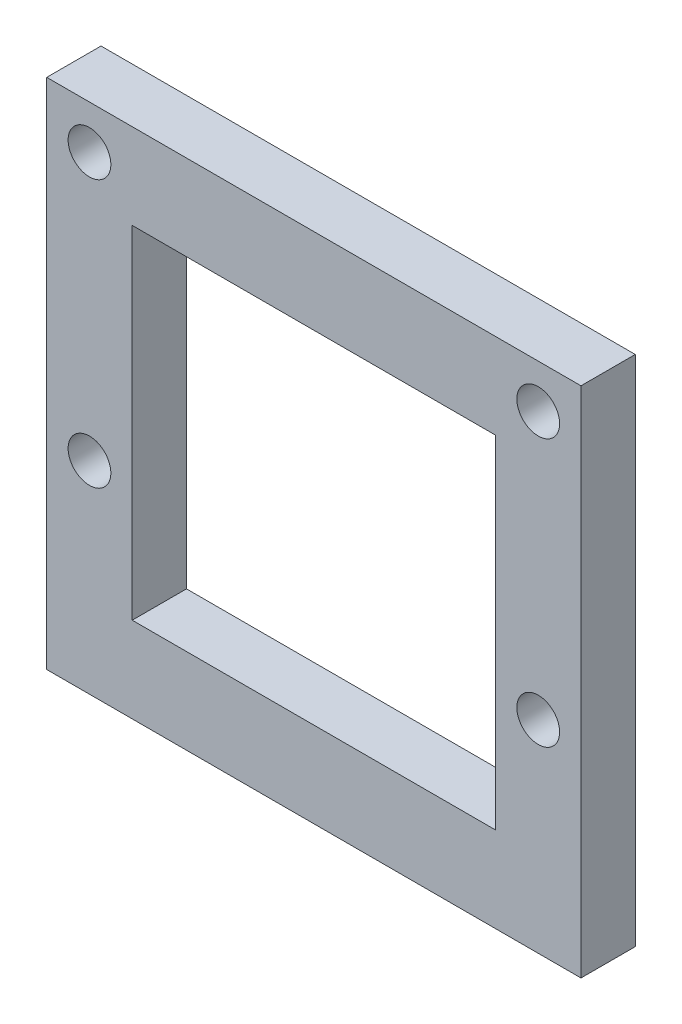
ISO-10303-21;
HEADER;
FILE_DESCRIPTION(('STEP AP214'),'2;1');
FILE_NAME('part.step','',(''),(''),'','','');
FILE_SCHEMA(('AUTOMOTIVE_DESIGN { 1 0 10303 214 1 1 1 1 }'));
ENDSEC;
DATA;
#1=APPLICATION_CONTEXT('core data for automotive mechanical design processes');
#2=APPLICATION_PROTOCOL_DEFINITION('international standard','automotive_design',2000,#1);
#3=PRODUCT_CONTEXT('',#1,'mechanical');
#4=PRODUCT('Part','Part','',(#3));
#5=PRODUCT_RELATED_PRODUCT_CATEGORY('part','',(#4));
#6=PRODUCT_DEFINITION_FORMATION('','',#4);
#7=PRODUCT_DEFINITION_CONTEXT('part definition',#1,'design');
#8=PRODUCT_DEFINITION('design','',#6,#7);
#9=PRODUCT_DEFINITION_SHAPE('','',#8);
#10=(LENGTH_UNIT() NAMED_UNIT(*) SI_UNIT(.MILLI.,.METRE.));
#11=(NAMED_UNIT(*) PLANE_ANGLE_UNIT() SI_UNIT($,.RADIAN.));
#12=(NAMED_UNIT(*) SI_UNIT($,.STERADIAN.) SOLID_ANGLE_UNIT());
#13=UNCERTAINTY_MEASURE_WITH_UNIT(LENGTH_MEASURE(1.E-05),#10,'distance_accuracy_value','');
#14=(GEOMETRIC_REPRESENTATION_CONTEXT(3) GLOBAL_UNCERTAINTY_ASSIGNED_CONTEXT((#13)) GLOBAL_UNIT_ASSIGNED_CONTEXT((#10,
#11,#12)) REPRESENTATION_CONTEXT('',''));
#15=CARTESIAN_POINT('',(0.,0.,0.));
#16=DIRECTION('',(0.,0.,1.));
#17=DIRECTION('',(1.,0.,0.));
#18=AXIS2_PLACEMENT_3D('',#15,#16,#17);
#19=CARTESIAN_POINT('',(0.,0.,2.54));
#20=DIRECTION('',(0.,0.,1.));
#21=DIRECTION('',(1.,0.,0.));
#22=AXIS2_PLACEMENT_3D('',#19,#20,#21);
#23=PLANE('',#22);
#24=CARTESIAN_POINT('',(-10.500000336,-2.53656255804224,2.54));
#25=DIRECTION('',(0.,0.,1.));
#26=DIRECTION('',(1.,0.,0.));
#27=AXIS2_PLACEMENT_3D('',#24,#25,#26);
#28=CIRCLE('',#27,1.000000032);
#29=CARTESIAN_POINT('',(-9.500000304,-2.53656255804224,2.54));
#30=VERTEX_POINT('',#29);
#31=EDGE_CURVE('E46',#30,#30,#28,.F.);
#32=ORIENTED_EDGE('',*,*,#31,.T.);
#33=EDGE_LOOP('',(#32));
#34=FACE_BOUND('',#33,.T.);
#35=CARTESIAN_POINT('',(10.500000336,9.96343784195776,2.54));
#36=DIRECTION('',(0.,0.,1.));
#37=DIRECTION('',(1.,0.,0.));
#38=AXIS2_PLACEMENT_3D('',#35,#36,#37);
#39=CIRCLE('',#38,1.000000032);
#40=CARTESIAN_POINT('',(11.500000368,9.96343784195776,2.54));
#41=VERTEX_POINT('',#40);
#42=EDGE_CURVE('E203',#41,#41,#39,.F.);
#43=ORIENTED_EDGE('',*,*,#42,.T.);
#44=EDGE_LOOP('',(#43));
#45=FACE_BOUND('',#44,.T.);
#46=CARTESIAN_POINT('',(10.500000336,-2.53656255804224,2.54));
#47=DIRECTION('',(0.,0.,1.));
#48=DIRECTION('',(1.,0.,0.));
#49=AXIS2_PLACEMENT_3D('',#46,#47,#48);
#50=CIRCLE('',#49,1.000000032);
#51=CARTESIAN_POINT('',(11.500000368,-2.53656255804224,2.54));
#52=VERTEX_POINT('',#51);
#53=EDGE_CURVE('E199',#52,#52,#50,.F.);
#54=ORIENTED_EDGE('',*,*,#53,.T.);
#55=EDGE_LOOP('',(#54));
#56=FACE_BOUND('',#55,.T.);
#57=CARTESIAN_POINT('',(-10.500000336,9.96343784195776,2.54));
#58=DIRECTION('',(0.,0.,1.));
#59=DIRECTION('',(1.,0.,0.));
#60=AXIS2_PLACEMENT_3D('',#57,#58,#59);
#61=CIRCLE('',#60,1.000000032);
#62=CARTESIAN_POINT('',(-9.500000304,9.96343784195776,2.54));
#63=VERTEX_POINT('',#62);
#64=EDGE_CURVE('E195',#63,#63,#61,.F.);
#65=ORIENTED_EDGE('',*,*,#64,.T.);
#66=EDGE_LOOP('',(#65));
#67=FACE_BOUND('',#66,.T.);
#68=DIRECTION('',(0.,1.,0.));
#69=VECTOR('',#68,1.);
#70=CARTESIAN_POINT('',(12.5000004,12.00000013,2.54));
#71=LINE('',#70,#69);
#72=CARTESIAN_POINT('',(12.5000004,-12.00000013,2.54));
#73=VERTEX_POINT('',#72);
#74=CARTESIAN_POINT('',(12.5000004,12.00000013,2.54));
#75=VERTEX_POINT('',#74);
#76=EDGE_CURVE('E159',#73,#75,#71,.T.);
#77=ORIENTED_EDGE('',*,*,#76,.T.);
#78=DIRECTION('',(-1.,0.,0.));
#79=VECTOR('',#78,1.);
#80=CARTESIAN_POINT('',(-12.5000004,12.00000013,2.54));
#81=LINE('',#80,#79);
#82=CARTESIAN_POINT('',(-12.5000004,12.00000013,2.54));
#83=VERTEX_POINT('',#82);
#84=EDGE_CURVE('E163',#75,#83,#81,.T.);
#85=ORIENTED_EDGE('',*,*,#84,.T.);
#86=DIRECTION('',(0.,-1.,0.));
#87=VECTOR('',#86,1.);
#88=CARTESIAN_POINT('',(-12.5000004,12.00000013,2.54));
#89=LINE('',#88,#87);
#90=CARTESIAN_POINT('',(-12.5000004,-12.00000013,2.54));
#91=VERTEX_POINT('',#90);
#92=EDGE_CURVE('E167',#83,#91,#89,.T.);
#93=ORIENTED_EDGE('',*,*,#92,.T.);
#94=DIRECTION('',(1.,0.,0.));
#95=VECTOR('',#94,1.);
#96=CARTESIAN_POINT('',(-12.5000004,-12.00000013,2.54));
#97=LINE('',#96,#95);
#98=EDGE_CURVE('E170',#91,#73,#97,.T.);
#99=ORIENTED_EDGE('',*,*,#98,.T.);
#100=EDGE_LOOP('',(#77,#85,#93,#99));
#101=FACE_BOUND('',#100,.T.);
#102=DIRECTION('',(-1.,0.,0.));
#103=VECTOR('',#102,1.);
#104=CARTESIAN_POINT('',(-8.500000272,8.000000002,2.54));
#105=LINE('',#104,#103);
#106=CARTESIAN_POINT('',(8.50000027199999,8.000000002,2.54));
#107=VERTEX_POINT('',#106);
#108=CARTESIAN_POINT('',(-8.500000272,8.000000002,2.54));
#109=VERTEX_POINT('',#108);
#110=EDGE_CURVE('E119',#107,#109,#105,.T.);
#111=ORIENTED_EDGE('',*,*,#110,.F.);
#112=DIRECTION('',(0.,1.,0.));
#113=VECTOR('',#112,1.);
#114=CARTESIAN_POINT('',(8.50000027199999,-8.000000002,2.54));
#115=LINE('',#114,#113);
#116=CARTESIAN_POINT('',(8.50000027199999,-8.000000002,2.54));
#117=VERTEX_POINT('',#116);
#118=EDGE_CURVE('E110',#117,#107,#115,.T.);
#119=ORIENTED_EDGE('',*,*,#118,.F.);
#120=DIRECTION('',(1.,0.,0.));
#121=VECTOR('',#120,1.);
#122=CARTESIAN_POINT('',(-8.500000272,-8.000000002,2.54));
#123=LINE('',#122,#121);
#124=CARTESIAN_POINT('',(-8.500000272,-8.000000002,2.54));
#125=VERTEX_POINT('',#124);
#126=EDGE_CURVE('E136',#125,#117,#123,.T.);
#127=ORIENTED_EDGE('',*,*,#126,.F.);
#128=DIRECTION('',(0.,-1.,0.));
#129=VECTOR('',#128,1.);
#130=CARTESIAN_POINT('',(-8.500000272,-8.000000002,2.54));
#131=LINE('',#130,#129);
#132=EDGE_CURVE('E132',#109,#125,#131,.T.);
#133=ORIENTED_EDGE('',*,*,#132,.F.);
#134=EDGE_LOOP('',(#111,#119,#127,#133));
#135=FACE_BOUND('',#134,.T.);
#136=ADVANCED_FACE('F42',(#34,#45,#56,#67,#101,#135),#23,.T.);
#137=CARTESIAN_POINT('',(0.,0.,0.));
#138=DIRECTION('',(0.,0.,1.));
#139=DIRECTION('',(1.,0.,0.));
#140=AXIS2_PLACEMENT_3D('',#137,#138,#139);
#141=PLANE('',#140);
#142=DIRECTION('',(0.,1.,0.));
#143=VECTOR('',#142,1.);
#144=CARTESIAN_POINT('',(12.5000004,12.00000013,0.));
#145=LINE('',#144,#143);
#146=CARTESIAN_POINT('',(12.5000004,-12.00000013,0.));
#147=VERTEX_POINT('',#146);
#148=CARTESIAN_POINT('',(12.5000004,12.00000013,0.));
#149=VERTEX_POINT('',#148);
#150=EDGE_CURVE('E128',#147,#149,#145,.T.);
#151=ORIENTED_EDGE('',*,*,#150,.F.);
#152=DIRECTION('',(1.,0.,0.));
#153=VECTOR('',#152,1.);
#154=CARTESIAN_POINT('',(-12.5000004,-12.00000013,0.));
#155=LINE('',#154,#153);
#156=CARTESIAN_POINT('',(-12.5000004,-12.00000013,0.));
#157=VERTEX_POINT('',#156);
#158=EDGE_CURVE('E164',#157,#147,#155,.T.);
#159=ORIENTED_EDGE('',*,*,#158,.F.);
#160=DIRECTION('',(0.,-1.,0.));
#161=VECTOR('',#160,1.);
#162=CARTESIAN_POINT('',(-12.5000004,12.00000013,0.));
#163=LINE('',#162,#161);
#164=CARTESIAN_POINT('',(-12.5000004,12.00000013,0.));
#165=VERTEX_POINT('',#164);
#166=EDGE_CURVE('E180',#165,#157,#163,.T.);
#167=ORIENTED_EDGE('',*,*,#166,.F.);
#168=DIRECTION('',(-1.,0.,0.));
#169=VECTOR('',#168,1.);
#170=CARTESIAN_POINT('',(-12.5000004,12.00000013,0.));
#171=LINE('',#170,#169);
#172=EDGE_CURVE('E177',#149,#165,#171,.T.);
#173=ORIENTED_EDGE('',*,*,#172,.F.);
#174=EDGE_LOOP('',(#151,#159,#167,#173));
#175=FACE_BOUND('',#174,.T.);
#176=DIRECTION('',(0.,1.,0.));
#177=VECTOR('',#176,1.);
#178=CARTESIAN_POINT('',(8.50000027199999,-8.000000002,0.));
#179=LINE('',#178,#177);
#180=CARTESIAN_POINT('',(8.50000027199999,-8.000000002,0.));
#181=VERTEX_POINT('',#180);
#182=CARTESIAN_POINT('',(8.50000027199999,8.000000002,0.));
#183=VERTEX_POINT('',#182);
#184=EDGE_CURVE('E68',#181,#183,#179,.T.);
#185=ORIENTED_EDGE('',*,*,#184,.T.);
#186=DIRECTION('',(-1.,0.,0.));
#187=VECTOR('',#186,1.);
#188=CARTESIAN_POINT('',(-8.500000272,8.000000002,0.));
#189=LINE('',#188,#187);
#190=CARTESIAN_POINT('',(-8.500000272,8.000000002,0.));
#191=VERTEX_POINT('',#190);
#192=EDGE_CURVE('E126',#183,#191,#189,.T.);
#193=ORIENTED_EDGE('',*,*,#192,.T.);
#194=DIRECTION('',(0.,-1.,0.));
#195=VECTOR('',#194,1.);
#196=CARTESIAN_POINT('',(-8.500000272,-8.000000002,0.));
#197=LINE('',#196,#195);
#198=CARTESIAN_POINT('',(-8.500000272,-8.000000002,0.));
#199=VERTEX_POINT('',#198);
#200=EDGE_CURVE('E146',#191,#199,#197,.T.);
#201=ORIENTED_EDGE('',*,*,#200,.T.);
#202=DIRECTION('',(1.,0.,0.));
#203=VECTOR('',#202,1.);
#204=CARTESIAN_POINT('',(-8.500000272,-8.000000002,0.));
#205=LINE('',#204,#203);
#206=EDGE_CURVE('E120',#199,#181,#205,.T.);
#207=ORIENTED_EDGE('',*,*,#206,.T.);
#208=EDGE_LOOP('',(#185,#193,#201,#207));
#209=FACE_BOUND('',#208,.T.);
#210=ADVANCED_FACE('F255',(#175,#209),#141,.F.);
#211=CARTESIAN_POINT('',(12.5000004,12.00000013,2.54));
#212=DIRECTION('',(-1.,0.,0.));
#213=DIRECTION('',(0.,-1.,0.));
#214=AXIS2_PLACEMENT_3D('',#211,#212,#213);
#215=PLANE('',#214);
#216=ORIENTED_EDGE('',*,*,#150,.T.);
#217=DIRECTION('',(0.,0.,-1.));
#218=VECTOR('',#217,1.);
#219=CARTESIAN_POINT('',(12.5000004,12.00000013,2.54));
#220=LINE('',#219,#218);
#221=EDGE_CURVE('E11',#75,#149,#220,.T.);
#222=ORIENTED_EDGE('',*,*,#221,.F.);
#223=ORIENTED_EDGE('',*,*,#76,.F.);
#224=DIRECTION('',(0.,0.,-1.));
#225=VECTOR('',#224,1.);
#226=CARTESIAN_POINT('',(12.5000004,-12.00000013,2.54));
#227=LINE('',#226,#225);
#228=EDGE_CURVE('E173',#73,#147,#227,.T.);
#229=ORIENTED_EDGE('',*,*,#228,.T.);
#230=EDGE_LOOP('',(#216,#222,#223,#229));
#231=FACE_BOUND('',#230,.T.);
#232=ADVANCED_FACE('F44',(#231),#215,.F.);
#233=CARTESIAN_POINT('',(-12.5000004,12.00000013,2.54));
#234=DIRECTION('',(0.,-1.,0.));
#235=DIRECTION('',(0.,0.,-1.));
#236=AXIS2_PLACEMENT_3D('',#233,#234,#235);
#237=PLANE('',#236);
#238=ORIENTED_EDGE('',*,*,#172,.T.);
#239=DIRECTION('',(0.,0.,-1.));
#240=VECTOR('',#239,1.);
#241=CARTESIAN_POINT('',(-12.5000004,12.00000013,2.54));
#242=LINE('',#241,#240);
#243=EDGE_CURVE('E52',#83,#165,#242,.T.);
#244=ORIENTED_EDGE('',*,*,#243,.F.);
#245=ORIENTED_EDGE('',*,*,#84,.F.);
#246=ORIENTED_EDGE('',*,*,#221,.T.);
#247=EDGE_LOOP('',(#238,#244,#245,#246));
#248=FACE_BOUND('',#247,.T.);
#249=ADVANCED_FACE('F271',(#248),#237,.F.);
#250=CARTESIAN_POINT('',(-12.5000004,12.00000013,2.54));
#251=DIRECTION('',(1.,0.,0.));
#252=DIRECTION('',(0.,1.,0.));
#253=AXIS2_PLACEMENT_3D('',#250,#251,#252);
#254=PLANE('',#253);
#255=ORIENTED_EDGE('',*,*,#166,.T.);
#256=DIRECTION('',(0.,0.,-1.));
#257=VECTOR('',#256,1.);
#258=CARTESIAN_POINT('',(-12.5000004,-12.00000013,2.54));
#259=LINE('',#258,#257);
#260=EDGE_CURVE('E188',#91,#157,#259,.T.);
#261=ORIENTED_EDGE('',*,*,#260,.F.);
#262=ORIENTED_EDGE('',*,*,#92,.F.);
#263=ORIENTED_EDGE('',*,*,#243,.T.);
#264=EDGE_LOOP('',(#255,#261,#262,#263));
#265=FACE_BOUND('',#264,.T.);
#266=ADVANCED_FACE('F268',(#265),#254,.F.);
#267=CARTESIAN_POINT('',(-12.5000004,-12.00000013,2.54));
#268=DIRECTION('',(0.,1.,0.));
#269=DIRECTION('',(0.,0.,1.));
#270=AXIS2_PLACEMENT_3D('',#267,#268,#269);
#271=PLANE('',#270);
#272=ORIENTED_EDGE('',*,*,#158,.T.);
#273=ORIENTED_EDGE('',*,*,#228,.F.);
#274=ORIENTED_EDGE('',*,*,#98,.F.);
#275=ORIENTED_EDGE('',*,*,#260,.T.);
#276=EDGE_LOOP('',(#272,#273,#274,#275));
#277=FACE_BOUND('',#276,.T.);
#278=ADVANCED_FACE('F265',(#277),#271,.F.);
#279=CARTESIAN_POINT('',(8.50000027199999,-8.000000002,2.54));
#280=DIRECTION('',(-1.,0.,0.));
#281=DIRECTION('',(0.,0.,1.));
#282=AXIS2_PLACEMENT_3D('',#279,#280,#281);
#283=PLANE('',#282);
#284=ORIENTED_EDGE('',*,*,#184,.F.);
#285=DIRECTION('',(0.,0.,-1.));
#286=VECTOR('',#285,1.);
#287=CARTESIAN_POINT('',(8.50000027199999,-8.000000002,2.54));
#288=LINE('',#287,#286);
#289=EDGE_CURVE('E114',#117,#181,#288,.T.);
#290=ORIENTED_EDGE('',*,*,#289,.F.);
#291=ORIENTED_EDGE('',*,*,#118,.T.);
#292=DIRECTION('',(0.,0.,-1.));
#293=VECTOR('',#292,1.);
#294=CARTESIAN_POINT('',(8.50000027199999,8.000000002,2.54));
#295=LINE('',#294,#293);
#296=EDGE_CURVE('E113',#107,#183,#295,.T.);
#297=ORIENTED_EDGE('',*,*,#296,.T.);
#298=EDGE_LOOP('',(#284,#290,#291,#297));
#299=FACE_BOUND('',#298,.T.);
#300=ADVANCED_FACE('F112',(#299),#283,.T.);
#301=CARTESIAN_POINT('',(-8.500000272,8.000000002,2.54));
#302=DIRECTION('',(0.,-1.,0.));
#303=DIRECTION('',(0.,0.,-1.));
#304=AXIS2_PLACEMENT_3D('',#301,#302,#303);
#305=PLANE('',#304);
#306=ORIENTED_EDGE('',*,*,#192,.F.);
#307=ORIENTED_EDGE('',*,*,#296,.F.);
#308=ORIENTED_EDGE('',*,*,#110,.T.);
#309=DIRECTION('',(0.,0.,-1.));
#310=VECTOR('',#309,1.);
#311=CARTESIAN_POINT('',(-8.500000272,8.000000002,2.54));
#312=LINE('',#311,#310);
#313=EDGE_CURVE('E129',#109,#191,#312,.T.);
#314=ORIENTED_EDGE('',*,*,#313,.T.);
#315=EDGE_LOOP('',(#306,#307,#308,#314));
#316=FACE_BOUND('',#315,.T.);
#317=ADVANCED_FACE('F123',(#316),#305,.T.);
#318=CARTESIAN_POINT('',(-8.500000272,-8.000000002,2.54));
#319=DIRECTION('',(1.,0.,0.));
#320=DIRECTION('',(0.,0.,-1.));
#321=AXIS2_PLACEMENT_3D('',#318,#319,#320);
#322=PLANE('',#321);
#323=ORIENTED_EDGE('',*,*,#200,.F.);
#324=ORIENTED_EDGE('',*,*,#313,.F.);
#325=ORIENTED_EDGE('',*,*,#132,.T.);
#326=DIRECTION('',(0.,0.,-1.));
#327=VECTOR('',#326,1.);
#328=CARTESIAN_POINT('',(-8.500000272,-8.000000002,2.54));
#329=LINE('',#328,#327);
#330=EDGE_CURVE('E60',#125,#199,#329,.T.);
#331=ORIENTED_EDGE('',*,*,#330,.T.);
#332=EDGE_LOOP('',(#323,#324,#325,#331));
#333=FACE_BOUND('',#332,.T.);
#334=ADVANCED_FACE('F294',(#333),#322,.T.);
#335=CARTESIAN_POINT('',(-8.500000272,-8.000000002,2.54));
#336=DIRECTION('',(0.,1.,0.));
#337=DIRECTION('',(0.,0.,1.));
#338=AXIS2_PLACEMENT_3D('',#335,#336,#337);
#339=PLANE('',#338);
#340=ORIENTED_EDGE('',*,*,#206,.F.);
#341=ORIENTED_EDGE('',*,*,#330,.F.);
#342=ORIENTED_EDGE('',*,*,#126,.T.);
#343=ORIENTED_EDGE('',*,*,#289,.T.);
#344=EDGE_LOOP('',(#340,#341,#342,#343));
#345=FACE_BOUND('',#344,.T.);
#346=ADVANCED_FACE('F292',(#345),#339,.T.);
#347=CARTESIAN_POINT('',(-10.500000336,9.96343784195776,3.175));
#348=DIRECTION('',(0.,0.,-1.));
#349=DIRECTION('',(-1.,0.,0.));
#350=AXIS2_PLACEMENT_3D('',#347,#348,#349);
#351=CYLINDRICAL_SURFACE('',#350,1.000000032);
#352=ORIENTED_EDGE('',*,*,#64,.F.);
#353=EDGE_LOOP('',(#352));
#354=FACE_BOUND('',#353,.T.);
#355=CARTESIAN_POINT('',(-10.500000336,9.96343784195776,0.635));
#356=DIRECTION('',(0.,0.,1.));
#357=DIRECTION('',(1.,0.,0.));
#358=AXIS2_PLACEMENT_3D('',#355,#356,#357);
#359=CIRCLE('',#358,1.000000032);
#360=CARTESIAN_POINT('',(-9.500000304,9.96343784195776,0.635));
#361=VERTEX_POINT('',#360);
#362=EDGE_CURVE('E200',#361,#361,#359,.T.);
#363=ORIENTED_EDGE('',*,*,#362,.F.);
#364=EDGE_LOOP('',(#363));
#365=FACE_BOUND('',#364,.T.);
#366=ADVANCED_FACE('F250',(#354,#365),#351,.F.);
#367=CARTESIAN_POINT('',(-10.500000336,9.96343784195776,0.635));
#368=DIRECTION('',(0.,0.,1.));
#369=DIRECTION('',(1.,0.,0.));
#370=AXIS2_PLACEMENT_3D('',#367,#368,#369);
#371=PLANE('',#370);
#372=ORIENTED_EDGE('',*,*,#362,.T.);
#373=EDGE_LOOP('',(#372));
#374=FACE_BOUND('',#373,.T.);
#375=ADVANCED_FACE('F241',(#374),#371,.T.);
#376=CARTESIAN_POINT('',(10.500000336,-2.53656255804224,3.175));
#377=DIRECTION('',(0.,0.,-1.));
#378=DIRECTION('',(-1.,0.,0.));
#379=AXIS2_PLACEMENT_3D('',#376,#377,#378);
#380=CYLINDRICAL_SURFACE('',#379,1.000000032);
#381=ORIENTED_EDGE('',*,*,#53,.F.);
#382=EDGE_LOOP('',(#381));
#383=FACE_BOUND('',#382,.T.);
#384=CARTESIAN_POINT('',(10.500000336,-2.53656255804224,0.635));
#385=DIRECTION('',(0.,0.,1.));
#386=DIRECTION('',(1.,0.,0.));
#387=AXIS2_PLACEMENT_3D('',#384,#385,#386);
#388=CIRCLE('',#387,1.000000032);
#389=CARTESIAN_POINT('',(11.500000368,-2.53656255804224,0.635));
#390=VERTEX_POINT('',#389);
#391=EDGE_CURVE('E230',#390,#390,#388,.T.);
#392=ORIENTED_EDGE('',*,*,#391,.F.);
#393=EDGE_LOOP('',(#392));
#394=FACE_BOUND('',#393,.T.);
#395=ADVANCED_FACE('F239',(#383,#394),#380,.F.);
#396=CARTESIAN_POINT('',(10.500000336,-2.53656255804224,0.635));
#397=DIRECTION('',(0.,0.,1.));
#398=DIRECTION('',(1.,0.,0.));
#399=AXIS2_PLACEMENT_3D('',#396,#397,#398);
#400=PLANE('',#399);
#401=ORIENTED_EDGE('',*,*,#391,.T.);
#402=EDGE_LOOP('',(#401));
#403=FACE_BOUND('',#402,.T.);
#404=ADVANCED_FACE('F237',(#403),#400,.T.);
#405=CARTESIAN_POINT('',(10.500000336,9.96343784195776,3.175));
#406=DIRECTION('',(0.,0.,-1.));
#407=DIRECTION('',(-1.,0.,0.));
#408=AXIS2_PLACEMENT_3D('',#405,#406,#407);
#409=CYLINDRICAL_SURFACE('',#408,1.000000032);
#410=ORIENTED_EDGE('',*,*,#42,.F.);
#411=EDGE_LOOP('',(#410));
#412=FACE_BOUND('',#411,.T.);
#413=CARTESIAN_POINT('',(10.500000336,9.96343784195776,0.635));
#414=DIRECTION('',(0.,0.,1.));
#415=DIRECTION('',(1.,0.,0.));
#416=AXIS2_PLACEMENT_3D('',#413,#414,#415);
#417=CIRCLE('',#416,1.000000032);
#418=CARTESIAN_POINT('',(11.500000368,9.96343784195776,0.635));
#419=VERTEX_POINT('',#418);
#420=EDGE_CURVE('E224',#419,#419,#417,.T.);
#421=ORIENTED_EDGE('',*,*,#420,.F.);
#422=EDGE_LOOP('',(#421));
#423=FACE_BOUND('',#422,.T.);
#424=ADVANCED_FACE('F248',(#412,#423),#409,.F.);
#425=CARTESIAN_POINT('',(10.500000336,9.96343784195776,0.635));
#426=DIRECTION('',(0.,0.,1.));
#427=DIRECTION('',(1.,0.,0.));
#428=AXIS2_PLACEMENT_3D('',#425,#426,#427);
#429=PLANE('',#428);
#430=ORIENTED_EDGE('',*,*,#420,.T.);
#431=EDGE_LOOP('',(#430));
#432=FACE_BOUND('',#431,.T.);
#433=ADVANCED_FACE('F217',(#432),#429,.T.);
#434=CARTESIAN_POINT('',(-10.500000336,-2.53656255804224,3.175));
#435=DIRECTION('',(0.,0.,-1.));
#436=DIRECTION('',(-1.,0.,0.));
#437=AXIS2_PLACEMENT_3D('',#434,#435,#436);
#438=CYLINDRICAL_SURFACE('',#437,1.000000032);
#439=ORIENTED_EDGE('',*,*,#31,.F.);
#440=EDGE_LOOP('',(#439));
#441=FACE_BOUND('',#440,.T.);
#442=CARTESIAN_POINT('',(-10.500000336,-2.53656255804224,0.635));
#443=DIRECTION('',(0.,0.,1.));
#444=DIRECTION('',(1.,0.,0.));
#445=AXIS2_PLACEMENT_3D('',#442,#443,#444);
#446=CIRCLE('',#445,1.000000032);
#447=CARTESIAN_POINT('',(-9.500000304,-2.53656255804224,0.635));
#448=VERTEX_POINT('',#447);
#449=EDGE_CURVE('E221',#448,#448,#446,.T.);
#450=ORIENTED_EDGE('',*,*,#449,.F.);
#451=EDGE_LOOP('',(#450));
#452=FACE_BOUND('',#451,.T.);
#453=ADVANCED_FACE('F213',(#441,#452),#438,.F.);
#454=CARTESIAN_POINT('',(-10.500000336,-2.53656255804224,0.635));
#455=DIRECTION('',(0.,0.,1.));
#456=DIRECTION('',(1.,0.,0.));
#457=AXIS2_PLACEMENT_3D('',#454,#455,#456);
#458=PLANE('',#457);
#459=ORIENTED_EDGE('',*,*,#449,.T.);
#460=EDGE_LOOP('',(#459));
#461=FACE_BOUND('',#460,.T.);
#462=ADVANCED_FACE('F216',(#461),#458,.T.);
#463=CLOSED_SHELL('',(#136,#210,#232,#249,#266,#278,#300,#317,#334,#346,#366,#375,#395,#404,
#424,#433,#453,#462));
#464=MANIFOLD_SOLID_BREP('B2',#463);
#465=ADVANCED_BREP_SHAPE_REPRESENTATION('',(#18,#464),#14);
#466=SHAPE_DEFINITION_REPRESENTATION(#9,#465);
ENDSEC;
END-ISO-10303-21;
